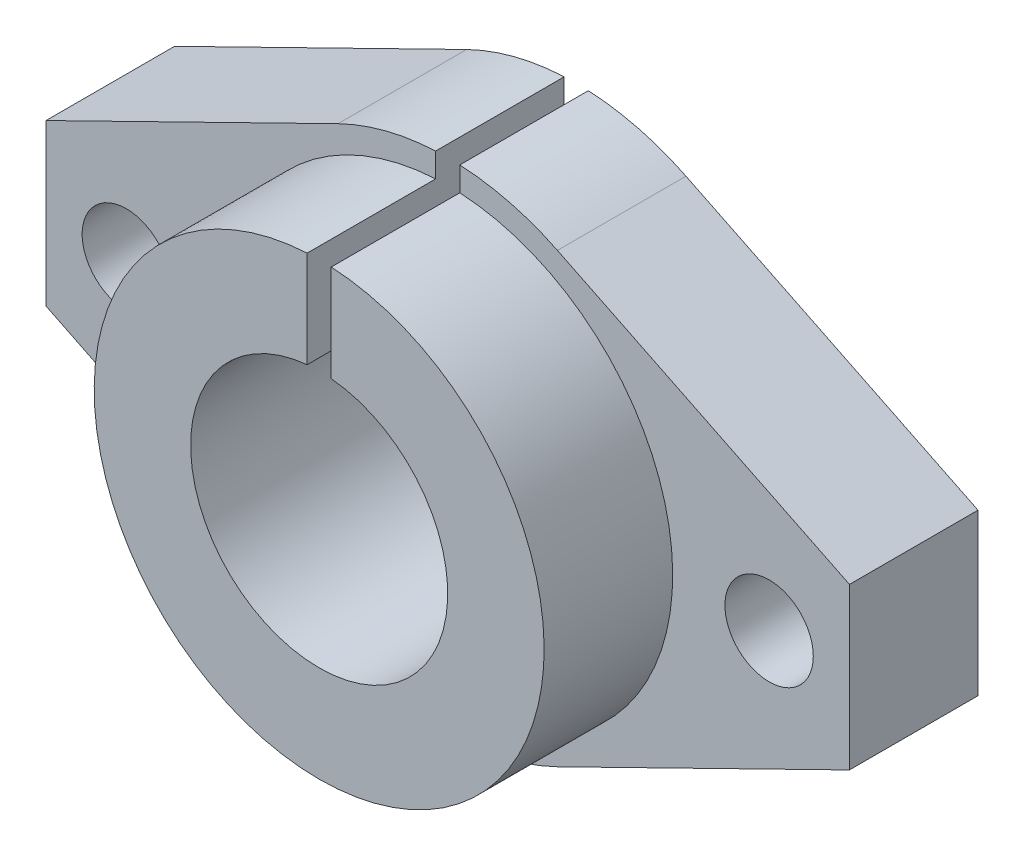
ISO-10303-21;
HEADER;
FILE_DESCRIPTION(('STEP AP214'),'2;1');
FILE_NAME('part.step','',(''),(''),'','','');
FILE_SCHEMA(('AUTOMOTIVE_DESIGN { 1 0 10303 214 1 1 1 1 }'));
ENDSEC;
DATA;
#1=APPLICATION_CONTEXT('core data for automotive mechanical design processes');
#2=APPLICATION_PROTOCOL_DEFINITION('international standard','automotive_design',2000,#1);
#3=PRODUCT_CONTEXT('',#1,'mechanical');
#4=PRODUCT('Part','Part','',(#3));
#5=PRODUCT_RELATED_PRODUCT_CATEGORY('part','',(#4));
#6=PRODUCT_DEFINITION_FORMATION('','',#4);
#7=PRODUCT_DEFINITION_CONTEXT('part definition',#1,'design');
#8=PRODUCT_DEFINITION('design','',#6,#7);
#9=PRODUCT_DEFINITION_SHAPE('','',#8);
#10=(LENGTH_UNIT() NAMED_UNIT(*) SI_UNIT(.MILLI.,.METRE.));
#11=(NAMED_UNIT(*) PLANE_ANGLE_UNIT() SI_UNIT($,.RADIAN.));
#12=(NAMED_UNIT(*) SI_UNIT($,.STERADIAN.) SOLID_ANGLE_UNIT());
#13=UNCERTAINTY_MEASURE_WITH_UNIT(LENGTH_MEASURE(1.E-05),#10,'distance_accuracy_value','');
#14=(GEOMETRIC_REPRESENTATION_CONTEXT(3) GLOBAL_UNCERTAINTY_ASSIGNED_CONTEXT((#13)) GLOBAL_UNIT_ASSIGNED_CONTEXT((#10,
#11,#12)) REPRESENTATION_CONTEXT('',''));
#15=CARTESIAN_POINT('',(0.,0.,0.));
#16=DIRECTION('',(0.,0.,1.));
#17=DIRECTION('',(1.,0.,0.));
#18=AXIS2_PLACEMENT_3D('',#15,#16,#17);
#19=CARTESIAN_POINT('',(0.,0.,8.));
#20=DIRECTION('',(0.,0.,-1.));
#21=DIRECTION('',(-1.,0.,0.));
#22=AXIS2_PLACEMENT_3D('',#19,#20,#21);
#23=CYLINDRICAL_SURFACE('',#22,15.5);
#24=CARTESIAN_POINT('',(0.,0.,0.));
#25=DIRECTION('',(0.,0.,1.));
#26=DIRECTION('',(1.,0.,0.));
#27=AXIS2_PLACEMENT_3D('',#24,#25,#26);
#28=CIRCLE('',#27,15.5);
#29=CARTESIAN_POINT('',(6.82688170430803,13.9155914784598,0.));
#30=VERTEX_POINT('',#29);
#31=CARTESIAN_POINT('',(0.75,15.481844205391,0.));
#32=VERTEX_POINT('',#31);
#33=EDGE_CURVE('E194',#30,#32,#28,.T.);
#34=ORIENTED_EDGE('',*,*,#33,.T.);
#35=DIRECTION('',(0.,0.,-1.));
#36=VECTOR('',#35,1.);
#37=CARTESIAN_POINT('',(0.75,15.481844205391,8.));
#38=LINE('',#37,#36);
#39=CARTESIAN_POINT('',(0.75,15.481844205391,8.));
#40=VERTEX_POINT('',#39);
#41=EDGE_CURVE('E241',#32,#40,#38,.F.);
#42=ORIENTED_EDGE('',*,*,#41,.T.);
#43=CARTESIAN_POINT('',(0.,0.,8.));
#44=DIRECTION('',(0.,0.,1.));
#45=DIRECTION('',(1.,0.,0.));
#46=AXIS2_PLACEMENT_3D('',#43,#44,#45);
#47=CIRCLE('',#46,15.5);
#48=CARTESIAN_POINT('',(6.82688170430803,13.9155914784598,8.));
#49=VERTEX_POINT('',#48);
#50=EDGE_CURVE('E178',#49,#40,#47,.T.);
#51=ORIENTED_EDGE('',*,*,#50,.F.);
#52=DIRECTION('',(0.,0.,-1.));
#53=VECTOR('',#52,1.);
#54=CARTESIAN_POINT('',(6.82688170430803,13.9155914784598,8.));
#55=LINE('',#54,#53);
#56=EDGE_CURVE('E203',#49,#30,#55,.T.);
#57=ORIENTED_EDGE('',*,*,#56,.T.);
#58=EDGE_LOOP('',(#34,#42,#51,#57));
#59=FACE_BOUND('',#58,.T.);
#60=ADVANCED_FACE('F32',(#59),#23,.T.);
#61=CARTESIAN_POINT('',(0.,0.,8.));
#62=DIRECTION('',(0.,0.,1.));
#63=DIRECTION('',(1.,0.,0.));
#64=AXIS2_PLACEMENT_3D('',#61,#62,#63);
#65=PLANE('',#64);
#66=DIRECTION('',(0.,1.,0.));
#67=VECTOR('',#66,1.);
#68=CARTESIAN_POINT('',(0.749999999999998,0.,8.));
#69=LINE('',#68,#67);
#70=CARTESIAN_POINT('',(0.749999999999999,13.9798962800158,8.));
#71=VERTEX_POINT('',#70);
#72=EDGE_CURVE('E239',#71,#40,#69,.T.);
#73=ORIENTED_EDGE('',*,*,#72,.F.);
#74=CARTESIAN_POINT('',(0.,0.,8.));
#75=DIRECTION('',(0.,0.,1.));
#76=DIRECTION('',(1.,0.,0.));
#77=AXIS2_PLACEMENT_3D('',#74,#75,#76);
#78=CIRCLE('',#77,14.);
#79=CARTESIAN_POINT('',(-0.750000000000001,13.9798962800158,8.));
#80=VERTEX_POINT('',#79);
#81=EDGE_CURVE('E153',#80,#71,#78,.T.);
#82=ORIENTED_EDGE('',*,*,#81,.F.);
#83=DIRECTION('',(0.,-1.,0.));
#84=VECTOR('',#83,1.);
#85=CARTESIAN_POINT('',(-0.750000000000002,0.,8.));
#86=LINE('',#85,#84);
#87=CARTESIAN_POINT('',(-0.75,15.481844205391,8.));
#88=VERTEX_POINT('',#87);
#89=EDGE_CURVE('E133',#88,#80,#86,.T.);
#90=ORIENTED_EDGE('',*,*,#89,.F.);
#91=CARTESIAN_POINT('',(-6.82688170430803,13.9155914784598,8.));
#92=VERTEX_POINT('',#91);
#93=EDGE_CURVE('E177',#88,#92,#47,.T.);
#94=ORIENTED_EDGE('',*,*,#93,.T.);
#95=DIRECTION('',(-0.897780095384506,-0.440443980923099,0.));
#96=VECTOR('',#95,1.);
#97=CARTESIAN_POINT('',(-6.82688170430803,13.9155914784598,8.));
#98=LINE('',#97,#96);
#99=CARTESIAN_POINT('',(-25.,5.,8.));
#100=VERTEX_POINT('',#99);
#101=EDGE_CURVE('E181',#92,#100,#98,.T.);
#102=ORIENTED_EDGE('',*,*,#101,.T.);
#103=DIRECTION('',(0.,-1.,0.));
#104=VECTOR('',#103,1.);
#105=CARTESIAN_POINT('',(-25.,-5.,8.));
#106=LINE('',#105,#104);
#107=CARTESIAN_POINT('',(-25.,-5.,8.));
#108=VERTEX_POINT('',#107);
#109=EDGE_CURVE('E163',#100,#108,#106,.T.);
#110=ORIENTED_EDGE('',*,*,#109,.T.);
#111=DIRECTION('',(0.897780095384506,-0.440443980923098,0.));
#112=VECTOR('',#111,1.);
#113=CARTESIAN_POINT('',(-6.82688170430803,-13.9155914784598,8.));
#114=LINE('',#113,#112);
#115=CARTESIAN_POINT('',(-6.82688170430803,-13.9155914784598,8.));
#116=VERTEX_POINT('',#115);
#117=EDGE_CURVE('E166',#108,#116,#114,.T.);
#118=ORIENTED_EDGE('',*,*,#117,.T.);
#119=CARTESIAN_POINT('',(0.,0.,8.));
#120=DIRECTION('',(0.,0.,1.));
#121=DIRECTION('',(1.,0.,0.));
#122=AXIS2_PLACEMENT_3D('',#119,#120,#121);
#123=CIRCLE('',#122,15.5);
#124=CARTESIAN_POINT('',(6.82688170430803,-13.9155914784598,8.));
#125=VERTEX_POINT('',#124);
#126=EDGE_CURVE('E169',#116,#125,#123,.T.);
#127=ORIENTED_EDGE('',*,*,#126,.T.);
#128=DIRECTION('',(0.897780095384506,0.440443980923099,0.));
#129=VECTOR('',#128,1.);
#130=CARTESIAN_POINT('',(6.82688170430803,-13.9155914784598,8.));
#131=LINE('',#130,#129);
#132=CARTESIAN_POINT('',(25.,-5.,8.));
#133=VERTEX_POINT('',#132);
#134=EDGE_CURVE('E171',#125,#133,#131,.T.);
#135=ORIENTED_EDGE('',*,*,#134,.T.);
#136=DIRECTION('',(0.,1.,0.));
#137=VECTOR('',#136,1.);
#138=CARTESIAN_POINT('',(25.,-5.,8.));
#139=LINE('',#138,#137);
#140=CARTESIAN_POINT('',(25.,5.,8.));
#141=VERTEX_POINT('',#140);
#142=EDGE_CURVE('E173',#133,#141,#139,.T.);
#143=ORIENTED_EDGE('',*,*,#142,.T.);
#144=DIRECTION('',(-0.897780095384506,0.440443980923099,0.));
#145=VECTOR('',#144,1.);
#146=CARTESIAN_POINT('',(6.82688170430803,13.9155914784598,8.));
#147=LINE('',#146,#145);
#148=EDGE_CURVE('E175',#141,#49,#147,.T.);
#149=ORIENTED_EDGE('',*,*,#148,.T.);
#150=ORIENTED_EDGE('',*,*,#50,.T.);
#151=EDGE_LOOP('',(#73,#82,#90,#94,#102,#110,#118,#127,#135,#143,#149,#150));
#152=FACE_BOUND('',#151,.T.);
#153=CARTESIAN_POINT('',(20.,0.,8.));
#154=DIRECTION('',(0.,0.,1.));
#155=DIRECTION('',(1.,0.,0.));
#156=AXIS2_PLACEMENT_3D('',#153,#154,#155);
#157=CIRCLE('',#156,2.75);
#158=CARTESIAN_POINT('',(22.75,0.,8.));
#159=VERTEX_POINT('',#158);
#160=EDGE_CURVE('E244',#159,#159,#157,.T.);
#161=ORIENTED_EDGE('',*,*,#160,.F.);
#162=EDGE_LOOP('',(#161));
#163=FACE_BOUND('',#162,.T.);
#164=CARTESIAN_POINT('',(-20.,0.,8.));
#165=DIRECTION('',(0.,0.,1.));
#166=DIRECTION('',(1.,0.,0.));
#167=AXIS2_PLACEMENT_3D('',#164,#165,#166);
#168=CIRCLE('',#167,2.75);
#169=CARTESIAN_POINT('',(-17.25,0.,8.));
#170=VERTEX_POINT('',#169);
#171=EDGE_CURVE('E248',#170,#170,#168,.T.);
#172=ORIENTED_EDGE('',*,*,#171,.F.);
#173=EDGE_LOOP('',(#172));
#174=FACE_BOUND('',#173,.T.);
#175=ADVANCED_FACE('F259',(#152,#163,#174),#65,.T.);
#176=CARTESIAN_POINT('',(-25.,-5.,8.));
#177=DIRECTION('',(1.,0.,0.));
#178=DIRECTION('',(0.,0.,-1.));
#179=AXIS2_PLACEMENT_3D('',#176,#177,#178);
#180=PLANE('',#179);
#181=DIRECTION('',(0.,-1.,0.));
#182=VECTOR('',#181,1.);
#183=CARTESIAN_POINT('',(-25.,-5.,0.));
#184=LINE('',#183,#182);
#185=CARTESIAN_POINT('',(-25.,5.,0.));
#186=VERTEX_POINT('',#185);
#187=CARTESIAN_POINT('',(-25.,-5.,0.));
#188=VERTEX_POINT('',#187);
#189=EDGE_CURVE('E152',#186,#188,#184,.T.);
#190=ORIENTED_EDGE('',*,*,#189,.T.);
#191=DIRECTION('',(0.,0.,-1.));
#192=VECTOR('',#191,1.);
#193=CARTESIAN_POINT('',(-25.,-5.,8.));
#194=LINE('',#193,#192);
#195=EDGE_CURVE('E218',#108,#188,#194,.T.);
#196=ORIENTED_EDGE('',*,*,#195,.F.);
#197=ORIENTED_EDGE('',*,*,#109,.F.);
#198=DIRECTION('',(0.,0.,-1.));
#199=VECTOR('',#198,1.);
#200=CARTESIAN_POINT('',(-25.,5.,8.));
#201=LINE('',#200,#199);
#202=EDGE_CURVE('E182',#100,#186,#201,.T.);
#203=ORIENTED_EDGE('',*,*,#202,.T.);
#204=EDGE_LOOP('',(#190,#196,#197,#203));
#205=FACE_BOUND('',#204,.T.);
#206=ADVANCED_FACE('F34',(#205),#180,.F.);
#207=CARTESIAN_POINT('',(-6.82688170430803,-13.9155914784598,8.));
#208=DIRECTION('',(0.440443980923099,0.897780095384506,0.));
#209=DIRECTION('',(-0.897780095384506,0.440443980923099,0.));
#210=AXIS2_PLACEMENT_3D('',#207,#208,#209);
#211=PLANE('',#210);
#212=DIRECTION('',(0.897780095384506,-0.440443980923098,0.));
#213=VECTOR('',#212,1.);
#214=CARTESIAN_POINT('',(-6.82688170430803,-13.9155914784598,0.));
#215=LINE('',#214,#213);
#216=CARTESIAN_POINT('',(-6.82688170430803,-13.9155914784598,0.));
#217=VERTEX_POINT('',#216);
#218=EDGE_CURVE('E156',#188,#217,#215,.T.);
#219=ORIENTED_EDGE('',*,*,#218,.T.);
#220=DIRECTION('',(0.,0.,-1.));
#221=VECTOR('',#220,1.);
#222=CARTESIAN_POINT('',(-6.82688170430803,-13.9155914784598,8.));
#223=LINE('',#222,#221);
#224=EDGE_CURVE('E215',#116,#217,#223,.T.);
#225=ORIENTED_EDGE('',*,*,#224,.F.);
#226=ORIENTED_EDGE('',*,*,#117,.F.);
#227=ORIENTED_EDGE('',*,*,#195,.T.);
#228=EDGE_LOOP('',(#219,#225,#226,#227));
#229=FACE_BOUND('',#228,.T.);
#230=ADVANCED_FACE('F267',(#229),#211,.F.);
#231=CARTESIAN_POINT('',(0.,0.,8.));
#232=DIRECTION('',(0.,0.,-1.));
#233=DIRECTION('',(-1.,0.,0.));
#234=AXIS2_PLACEMENT_3D('',#231,#232,#233);
#235=CYLINDRICAL_SURFACE('',#234,15.5);
#236=CARTESIAN_POINT('',(0.,0.,0.));
#237=DIRECTION('',(0.,0.,1.));
#238=DIRECTION('',(1.,0.,0.));
#239=AXIS2_PLACEMENT_3D('',#236,#237,#238);
#240=CIRCLE('',#239,15.5);
#241=CARTESIAN_POINT('',(6.82688170430803,-13.9155914784598,0.));
#242=VERTEX_POINT('',#241);
#243=EDGE_CURVE('E185',#217,#242,#240,.T.);
#244=ORIENTED_EDGE('',*,*,#243,.T.);
#245=DIRECTION('',(0.,0.,-1.));
#246=VECTOR('',#245,1.);
#247=CARTESIAN_POINT('',(6.82688170430803,-13.9155914784598,8.));
#248=LINE('',#247,#246);
#249=EDGE_CURVE('E212',#125,#242,#248,.T.);
#250=ORIENTED_EDGE('',*,*,#249,.F.);
#251=ORIENTED_EDGE('',*,*,#126,.F.);
#252=ORIENTED_EDGE('',*,*,#224,.T.);
#253=EDGE_LOOP('',(#244,#250,#251,#252));
#254=FACE_BOUND('',#253,.T.);
#255=ADVANCED_FACE('F297',(#254),#235,.T.);
#256=CARTESIAN_POINT('',(6.82688170430803,-13.9155914784598,8.));
#257=DIRECTION('',(-0.440443980923099,0.897780095384506,0.));
#258=DIRECTION('',(-0.897780095384506,-0.440443980923099,0.));
#259=AXIS2_PLACEMENT_3D('',#256,#257,#258);
#260=PLANE('',#259);
#261=DIRECTION('',(0.897780095384506,0.440443980923099,0.));
#262=VECTOR('',#261,1.);
#263=CARTESIAN_POINT('',(6.82688170430803,-13.9155914784598,0.));
#264=LINE('',#263,#262);
#265=CARTESIAN_POINT('',(25.,-5.,0.));
#266=VERTEX_POINT('',#265);
#267=EDGE_CURVE('E187',#242,#266,#264,.T.);
#268=ORIENTED_EDGE('',*,*,#267,.T.);
#269=DIRECTION('',(0.,0.,-1.));
#270=VECTOR('',#269,1.);
#271=CARTESIAN_POINT('',(25.,-5.,8.));
#272=LINE('',#271,#270);
#273=EDGE_CURVE('E209',#133,#266,#272,.T.);
#274=ORIENTED_EDGE('',*,*,#273,.F.);
#275=ORIENTED_EDGE('',*,*,#134,.F.);
#276=ORIENTED_EDGE('',*,*,#249,.T.);
#277=EDGE_LOOP('',(#268,#274,#275,#276));
#278=FACE_BOUND('',#277,.T.);
#279=ADVANCED_FACE('F293',(#278),#260,.F.);
#280=CARTESIAN_POINT('',(25.,-5.,8.));
#281=DIRECTION('',(-1.,0.,0.));
#282=DIRECTION('',(0.,0.,1.));
#283=AXIS2_PLACEMENT_3D('',#280,#281,#282);
#284=PLANE('',#283);
#285=DIRECTION('',(0.,1.,0.));
#286=VECTOR('',#285,1.);
#287=CARTESIAN_POINT('',(25.,-5.,0.));
#288=LINE('',#287,#286);
#289=CARTESIAN_POINT('',(25.,5.,0.));
#290=VERTEX_POINT('',#289);
#291=EDGE_CURVE('E189',#266,#290,#288,.T.);
#292=ORIENTED_EDGE('',*,*,#291,.T.);
#293=DIRECTION('',(0.,0.,-1.));
#294=VECTOR('',#293,1.);
#295=CARTESIAN_POINT('',(25.,5.,8.));
#296=LINE('',#295,#294);
#297=EDGE_CURVE('E206',#141,#290,#296,.T.);
#298=ORIENTED_EDGE('',*,*,#297,.F.);
#299=ORIENTED_EDGE('',*,*,#142,.F.);
#300=ORIENTED_EDGE('',*,*,#273,.T.);
#301=EDGE_LOOP('',(#292,#298,#299,#300));
#302=FACE_BOUND('',#301,.T.);
#303=ADVANCED_FACE('F289',(#302),#284,.F.);
#304=CARTESIAN_POINT('',(6.82688170430803,13.9155914784598,8.));
#305=DIRECTION('',(-0.440443980923099,-0.897780095384506,0.));
#306=DIRECTION('',(0.897780095384506,-0.440443980923099,0.));
#307=AXIS2_PLACEMENT_3D('',#304,#305,#306);
#308=PLANE('',#307);
#309=DIRECTION('',(-0.897780095384506,0.440443980923099,0.));
#310=VECTOR('',#309,1.);
#311=CARTESIAN_POINT('',(6.82688170430803,13.9155914784598,0.));
#312=LINE('',#311,#310);
#313=EDGE_CURVE('E191',#290,#30,#312,.T.);
#314=ORIENTED_EDGE('',*,*,#313,.T.);
#315=ORIENTED_EDGE('',*,*,#56,.F.);
#316=ORIENTED_EDGE('',*,*,#148,.F.);
#317=ORIENTED_EDGE('',*,*,#297,.T.);
#318=EDGE_LOOP('',(#314,#315,#316,#317));
#319=FACE_BOUND('',#318,.T.);
#320=ADVANCED_FACE('F285',(#319),#308,.F.);
#321=ORIENTED_EDGE('',*,*,#93,.F.);
#322=DIRECTION('',(0.,0.,-1.));
#323=VECTOR('',#322,1.);
#324=CARTESIAN_POINT('',(-0.75,15.481844205391,8.));
#325=LINE('',#324,#323);
#326=CARTESIAN_POINT('',(-0.75,15.481844205391,0.));
#327=VERTEX_POINT('',#326);
#328=EDGE_CURVE('E236',#88,#327,#325,.T.);
#329=ORIENTED_EDGE('',*,*,#328,.T.);
#330=CARTESIAN_POINT('',(-6.82688170430803,13.9155914784598,0.));
#331=VERTEX_POINT('',#330);
#332=EDGE_CURVE('E193',#327,#331,#28,.T.);
#333=ORIENTED_EDGE('',*,*,#332,.T.);
#334=DIRECTION('',(0.,0.,-1.));
#335=VECTOR('',#334,1.);
#336=CARTESIAN_POINT('',(-6.82688170430803,13.9155914784598,8.));
#337=LINE('',#336,#335);
#338=EDGE_CURVE('E200',#92,#331,#337,.T.);
#339=ORIENTED_EDGE('',*,*,#338,.F.);
#340=EDGE_LOOP('',(#321,#329,#333,#339));
#341=FACE_BOUND('',#340,.T.);
#342=ADVANCED_FACE('F271',(#341),#23,.T.);
#343=CARTESIAN_POINT('',(-6.82688170430803,13.9155914784598,8.));
#344=DIRECTION('',(0.440443980923099,-0.897780095384506,0.));
#345=DIRECTION('',(0.897780095384506,0.440443980923099,0.));
#346=AXIS2_PLACEMENT_3D('',#343,#344,#345);
#347=PLANE('',#346);
#348=DIRECTION('',(-0.897780095384506,-0.440443980923099,0.));
#349=VECTOR('',#348,1.);
#350=CARTESIAN_POINT('',(-6.82688170430803,13.9155914784598,0.));
#351=LINE('',#350,#349);
#352=EDGE_CURVE('E167',#331,#186,#351,.T.);
#353=ORIENTED_EDGE('',*,*,#352,.T.);
#354=ORIENTED_EDGE('',*,*,#202,.F.);
#355=ORIENTED_EDGE('',*,*,#101,.F.);
#356=ORIENTED_EDGE('',*,*,#338,.T.);
#357=EDGE_LOOP('',(#353,#354,#355,#356));
#358=FACE_BOUND('',#357,.T.);
#359=ADVANCED_FACE('F279',(#358),#347,.F.);
#360=CARTESIAN_POINT('',(0.,0.,0.));
#361=DIRECTION('',(0.,0.,1.));
#362=DIRECTION('',(1.,0.,0.));
#363=AXIS2_PLACEMENT_3D('',#360,#361,#362);
#364=PLANE('',#363);
#365=CARTESIAN_POINT('',(20.,0.,0.));
#366=DIRECTION('',(0.,0.,1.));
#367=DIRECTION('',(1.,0.,0.));
#368=AXIS2_PLACEMENT_3D('',#365,#366,#367);
#369=CIRCLE('',#368,2.75);
#370=CARTESIAN_POINT('',(22.75,0.,0.));
#371=VERTEX_POINT('',#370);
#372=EDGE_CURVE('E245',#371,#371,#369,.T.);
#373=ORIENTED_EDGE('',*,*,#372,.T.);
#374=EDGE_LOOP('',(#373));
#375=FACE_BOUND('',#374,.T.);
#376=CARTESIAN_POINT('',(-20.,0.,0.));
#377=DIRECTION('',(0.,0.,1.));
#378=DIRECTION('',(1.,0.,0.));
#379=AXIS2_PLACEMENT_3D('',#376,#377,#378);
#380=CIRCLE('',#379,2.75);
#381=CARTESIAN_POINT('',(-17.25,0.,0.));
#382=VERTEX_POINT('',#381);
#383=EDGE_CURVE('E251',#382,#382,#380,.T.);
#384=ORIENTED_EDGE('',*,*,#383,.T.);
#385=EDGE_LOOP('',(#384));
#386=FACE_BOUND('',#385,.T.);
#387=CARTESIAN_POINT('',(0.,0.,0.));
#388=DIRECTION('',(0.,0.,1.));
#389=DIRECTION('',(1.,0.,0.));
#390=AXIS2_PLACEMENT_3D('',#387,#388,#389);
#391=CIRCLE('',#390,8.);
#392=CARTESIAN_POINT('',(-0.750000000000001,7.96476616103699,0.));
#393=VERTEX_POINT('',#392);
#394=CARTESIAN_POINT('',(0.749999999999999,7.964766161037,0.));
#395=VERTEX_POINT('',#394);
#396=EDGE_CURVE('E158',#393,#395,#391,.T.);
#397=ORIENTED_EDGE('',*,*,#396,.T.);
#398=DIRECTION('',(0.,1.,0.));
#399=VECTOR('',#398,1.);
#400=CARTESIAN_POINT('',(0.750000000000001,25.,0.));
#401=LINE('',#400,#399);
#402=EDGE_CURVE('E55',#395,#32,#401,.T.);
#403=ORIENTED_EDGE('',*,*,#402,.T.);
#404=ORIENTED_EDGE('',*,*,#33,.F.);
#405=ORIENTED_EDGE('',*,*,#313,.F.);
#406=ORIENTED_EDGE('',*,*,#291,.F.);
#407=ORIENTED_EDGE('',*,*,#267,.F.);
#408=ORIENTED_EDGE('',*,*,#243,.F.);
#409=ORIENTED_EDGE('',*,*,#218,.F.);
#410=ORIENTED_EDGE('',*,*,#189,.F.);
#411=ORIENTED_EDGE('',*,*,#352,.F.);
#412=ORIENTED_EDGE('',*,*,#332,.F.);
#413=DIRECTION('',(0.,-1.,0.));
#414=VECTOR('',#413,1.);
#415=CARTESIAN_POINT('',(-0.749999999999999,25.,0.));
#416=LINE('',#415,#414);
#417=EDGE_CURVE('E225',#327,#393,#416,.T.);
#418=ORIENTED_EDGE('',*,*,#417,.T.);
#419=EDGE_LOOP('',(#397,#403,#404,#405,#406,#407,#408,#409,#410,#411,#412,#418));
#420=FACE_BOUND('',#419,.T.);
#421=ADVANCED_FACE('F229',(#375,#386,#420),#364,.F.);
#422=CARTESIAN_POINT('',(0.,0.,16.));
#423=DIRECTION('',(0.,0.,-1.));
#424=DIRECTION('',(-1.,0.,0.));
#425=AXIS2_PLACEMENT_3D('',#422,#423,#424);
#426=CYLINDRICAL_SURFACE('',#425,14.);
#427=ORIENTED_EDGE('',*,*,#81,.T.);
#428=DIRECTION('',(0.,0.,-1.));
#429=VECTOR('',#428,1.);
#430=CARTESIAN_POINT('',(0.749999999999999,13.9798962800158,16.));
#431=LINE('',#430,#429);
#432=CARTESIAN_POINT('',(0.75,13.9798962800158,16.));
#433=VERTEX_POINT('',#432);
#434=EDGE_CURVE('E151',#71,#433,#431,.F.);
#435=ORIENTED_EDGE('',*,*,#434,.T.);
#436=CARTESIAN_POINT('',(0.,0.,16.));
#437=DIRECTION('',(0.,0.,1.));
#438=DIRECTION('',(1.,0.,0.));
#439=AXIS2_PLACEMENT_3D('',#436,#437,#438);
#440=CIRCLE('',#439,14.);
#441=CARTESIAN_POINT('',(-0.75,13.9798962800158,16.));
#442=VERTEX_POINT('',#441);
#443=EDGE_CURVE('E144',#442,#433,#440,.T.);
#444=ORIENTED_EDGE('',*,*,#443,.F.);
#445=DIRECTION('',(0.,0.,-1.));
#446=VECTOR('',#445,1.);
#447=CARTESIAN_POINT('',(-0.750000000000001,13.9798962800158,16.));
#448=LINE('',#447,#446);
#449=EDGE_CURVE('E130',#442,#80,#448,.T.);
#450=ORIENTED_EDGE('',*,*,#449,.T.);
#451=EDGE_LOOP('',(#427,#435,#444,#450));
#452=FACE_BOUND('',#451,.T.);
#453=ADVANCED_FACE('F150',(#452),#426,.T.);
#454=CARTESIAN_POINT('',(0.,0.,16.));
#455=DIRECTION('',(0.,0.,1.));
#456=DIRECTION('',(1.,0.,0.));
#457=AXIS2_PLACEMENT_3D('',#454,#455,#456);
#458=PLANE('',#457);
#459=DIRECTION('',(0.,1.,0.));
#460=VECTOR('',#459,1.);
#461=CARTESIAN_POINT('',(0.750000000000001,25.,16.));
#462=LINE('',#461,#460);
#463=CARTESIAN_POINT('',(0.749999999999999,7.964766161037,16.));
#464=VERTEX_POINT('',#463);
#465=EDGE_CURVE('E147',#464,#433,#462,.T.);
#466=ORIENTED_EDGE('',*,*,#465,.F.);
#467=CARTESIAN_POINT('',(0.,0.,16.));
#468=DIRECTION('',(0.,0.,1.));
#469=DIRECTION('',(1.,0.,0.));
#470=AXIS2_PLACEMENT_3D('',#467,#468,#469);
#471=CIRCLE('',#470,8.);
#472=CARTESIAN_POINT('',(-0.750000000000001,7.964766161037,16.));
#473=VERTEX_POINT('',#472);
#474=EDGE_CURVE('E146',#473,#464,#471,.T.);
#475=ORIENTED_EDGE('',*,*,#474,.F.);
#476=DIRECTION('',(0.,-1.,0.));
#477=VECTOR('',#476,1.);
#478=CARTESIAN_POINT('',(-0.749999999999999,25.,16.));
#479=LINE('',#478,#477);
#480=EDGE_CURVE('E47',#442,#473,#479,.T.);
#481=ORIENTED_EDGE('',*,*,#480,.F.);
#482=ORIENTED_EDGE('',*,*,#443,.T.);
#483=EDGE_LOOP('',(#466,#475,#481,#482));
#484=FACE_BOUND('',#483,.T.);
#485=ADVANCED_FACE('F143',(#484),#458,.T.);
#486=CARTESIAN_POINT('',(0.,0.,0.));
#487=DIRECTION('',(0.,0.,1.));
#488=DIRECTION('',(1.,0.,0.));
#489=AXIS2_PLACEMENT_3D('',#486,#487,#488);
#490=CYLINDRICAL_SURFACE('',#489,8.);
#491=ORIENTED_EDGE('',*,*,#474,.T.);
#492=DIRECTION('',(0.,0.,1.));
#493=VECTOR('',#492,1.);
#494=CARTESIAN_POINT('',(0.749999999999999,7.964766161037,0.));
#495=LINE('',#494,#493);
#496=EDGE_CURVE('E11',#464,#395,#495,.F.);
#497=ORIENTED_EDGE('',*,*,#496,.T.);
#498=ORIENTED_EDGE('',*,*,#396,.F.);
#499=DIRECTION('',(0.,0.,1.));
#500=VECTOR('',#499,1.);
#501=CARTESIAN_POINT('',(-0.750000000000001,7.96476616103699,0.));
#502=LINE('',#501,#500);
#503=EDGE_CURVE('E40',#393,#473,#502,.T.);
#504=ORIENTED_EDGE('',*,*,#503,.T.);
#505=EDGE_LOOP('',(#491,#497,#498,#504));
#506=FACE_BOUND('',#505,.T.);
#507=ADVANCED_FACE('F222',(#506),#490,.F.);
#508=CARTESIAN_POINT('',(-20.,0.,0.));
#509=DIRECTION('',(0.,0.,1.));
#510=DIRECTION('',(1.,0.,0.));
#511=AXIS2_PLACEMENT_3D('',#508,#509,#510);
#512=CYLINDRICAL_SURFACE('',#511,2.75);
#513=ORIENTED_EDGE('',*,*,#383,.F.);
#514=EDGE_LOOP('',(#513));
#515=FACE_BOUND('',#514,.T.);
#516=ORIENTED_EDGE('',*,*,#171,.T.);
#517=EDGE_LOOP('',(#516));
#518=FACE_BOUND('',#517,.T.);
#519=ADVANCED_FACE('F257',(#515,#518),#512,.F.);
#520=CARTESIAN_POINT('',(20.,0.,0.));
#521=DIRECTION('',(0.,0.,1.));
#522=DIRECTION('',(1.,0.,0.));
#523=AXIS2_PLACEMENT_3D('',#520,#521,#522);
#524=CYLINDRICAL_SURFACE('',#523,2.75);
#525=ORIENTED_EDGE('',*,*,#372,.F.);
#526=EDGE_LOOP('',(#525));
#527=FACE_BOUND('',#526,.T.);
#528=ORIENTED_EDGE('',*,*,#160,.T.);
#529=EDGE_LOOP('',(#528));
#530=FACE_BOUND('',#529,.T.);
#531=ADVANCED_FACE('F333',(#527,#530),#524,.F.);
#532=CARTESIAN_POINT('',(-0.749999999999999,25.,0.));
#533=DIRECTION('',(-1.,0.,0.));
#534=DIRECTION('',(0.,-1.,0.));
#535=AXIS2_PLACEMENT_3D('',#532,#533,#534);
#536=PLANE('',#535);
#537=ORIENTED_EDGE('',*,*,#89,.T.);
#538=ORIENTED_EDGE('',*,*,#449,.F.);
#539=ORIENTED_EDGE('',*,*,#480,.T.);
#540=ORIENTED_EDGE('',*,*,#503,.F.);
#541=ORIENTED_EDGE('',*,*,#417,.F.);
#542=ORIENTED_EDGE('',*,*,#328,.F.);
#543=EDGE_LOOP('',(#537,#538,#539,#540,#541,#542));
#544=FACE_BOUND('',#543,.T.);
#545=ADVANCED_FACE('F131',(#544),#536,.F.);
#546=CARTESIAN_POINT('',(0.750000000000001,25.,0.));
#547=DIRECTION('',(1.,0.,0.));
#548=DIRECTION('',(0.,1.,0.));
#549=AXIS2_PLACEMENT_3D('',#546,#547,#548);
#550=PLANE('',#549);
#551=ORIENTED_EDGE('',*,*,#402,.F.);
#552=ORIENTED_EDGE('',*,*,#496,.F.);
#553=ORIENTED_EDGE('',*,*,#465,.T.);
#554=ORIENTED_EDGE('',*,*,#434,.F.);
#555=ORIENTED_EDGE('',*,*,#72,.T.);
#556=ORIENTED_EDGE('',*,*,#41,.F.);
#557=EDGE_LOOP('',(#551,#552,#553,#554,#555,#556));
#558=FACE_BOUND('',#557,.T.);
#559=ADVANCED_FACE('F326',(#558),#550,.F.);
#560=CLOSED_SHELL('',(#60,#175,#206,#230,#255,#279,#303,#320,#342,#359,#421,#453,#485,#507,#519,
#531,#545,#559));
#561=MANIFOLD_SOLID_BREP('B2',#560);
#562=ADVANCED_BREP_SHAPE_REPRESENTATION('',(#18,#561),#14);
#563=SHAPE_DEFINITION_REPRESENTATION(#9,#562);
ENDSEC;
END-ISO-10303-21;
